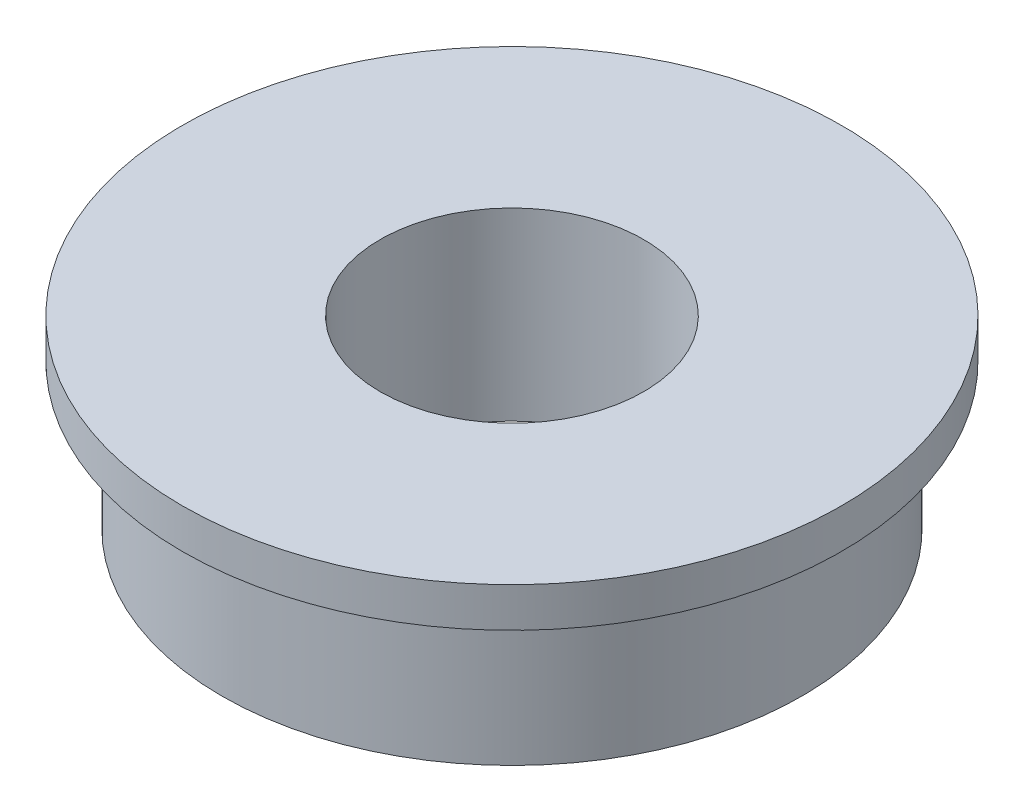
ISO-10303-21;
HEADER;
FILE_DESCRIPTION(('STEP AP214'),'2;1');
FILE_NAME('part.step','',(''),(''),'','','');
FILE_SCHEMA(('AUTOMOTIVE_DESIGN { 1 0 10303 214 1 1 1 1 }'));
ENDSEC;
DATA;
#1=APPLICATION_CONTEXT('core data for automotive mechanical design processes');
#2=APPLICATION_PROTOCOL_DEFINITION('international standard','automotive_design',2000,#1);
#3=PRODUCT_CONTEXT('',#1,'mechanical');
#4=PRODUCT('Part','Part','',(#3));
#5=PRODUCT_RELATED_PRODUCT_CATEGORY('part','',(#4));
#6=PRODUCT_DEFINITION_FORMATION('','',#4);
#7=PRODUCT_DEFINITION_CONTEXT('part definition',#1,'design');
#8=PRODUCT_DEFINITION('design','',#6,#7);
#9=PRODUCT_DEFINITION_SHAPE('','',#8);
#10=(LENGTH_UNIT() NAMED_UNIT(*) SI_UNIT(.MILLI.,.METRE.));
#11=(NAMED_UNIT(*) PLANE_ANGLE_UNIT() SI_UNIT($,.RADIAN.));
#12=(NAMED_UNIT(*) SI_UNIT($,.STERADIAN.) SOLID_ANGLE_UNIT());
#13=UNCERTAINTY_MEASURE_WITH_UNIT(LENGTH_MEASURE(1.E-05),#10,'distance_accuracy_value','');
#14=(GEOMETRIC_REPRESENTATION_CONTEXT(3) GLOBAL_UNCERTAINTY_ASSIGNED_CONTEXT((#13)) GLOBAL_UNIT_ASSIGNED_CONTEXT((#10,
#11,#12)) REPRESENTATION_CONTEXT('',''));
#15=CARTESIAN_POINT('',(0.,0.,0.));
#16=DIRECTION('',(0.,0.,1.));
#17=DIRECTION('',(1.,0.,0.));
#18=AXIS2_PLACEMENT_3D('',#15,#16,#17);
#19=CARTESIAN_POINT('',(0.,3.5,0.));
#20=DIRECTION('',(0.,-1.,0.));
#21=DIRECTION('',(0.,0.,-1.));
#22=AXIS2_PLACEMENT_3D('',#19,#20,#21);
#23=CYLINDRICAL_SURFACE('',#22,11.);
#24=CARTESIAN_POINT('',(0.,-3.5,0.));
#25=DIRECTION('',(0.,1.,0.));
#26=DIRECTION('',(0.,0.,1.));
#27=AXIS2_PLACEMENT_3D('',#24,#25,#26);
#28=CIRCLE('',#27,11.);
#29=CARTESIAN_POINT('',(0.,-3.5,11.));
#30=VERTEX_POINT('',#29);
#31=EDGE_CURVE('E36',#30,#30,#28,.T.);
#32=ORIENTED_EDGE('',*,*,#31,.T.);
#33=EDGE_LOOP('',(#32));
#34=FACE_BOUND('',#33,.T.);
#35=CARTESIAN_POINT('',(0.,2.,0.));
#36=DIRECTION('',(0.,1.,0.));
#37=DIRECTION('',(0.,0.,1.));
#38=AXIS2_PLACEMENT_3D('',#35,#36,#37);
#39=CIRCLE('',#38,11.);
#40=CARTESIAN_POINT('',(0.,2.,11.));
#41=VERTEX_POINT('',#40);
#42=EDGE_CURVE('E10',#41,#41,#39,.T.);
#43=ORIENTED_EDGE('',*,*,#42,.F.);
#44=EDGE_LOOP('',(#43));
#45=FACE_BOUND('',#44,.T.);
#46=ADVANCED_FACE('F30',(#34,#45),#23,.T.);
#47=CARTESIAN_POINT('',(0.,3.5,0.));
#48=DIRECTION('',(0.,1.,0.));
#49=DIRECTION('',(0.,0.,1.));
#50=AXIS2_PLACEMENT_3D('',#47,#48,#49);
#51=PLANE('',#50);
#52=CARTESIAN_POINT('',(0.,3.5,0.));
#53=DIRECTION('',(0.,1.,0.));
#54=DIRECTION('',(0.,0.,1.));
#55=AXIS2_PLACEMENT_3D('',#52,#53,#54);
#56=CIRCLE('',#55,5.);
#57=CARTESIAN_POINT('',(0.,3.5,5.));
#58=VERTEX_POINT('',#57);
#59=EDGE_CURVE('E40',#58,#58,#56,.T.);
#60=ORIENTED_EDGE('',*,*,#59,.F.);
#61=EDGE_LOOP('',(#60));
#62=FACE_BOUND('',#61,.T.);
#63=CARTESIAN_POINT('',(0.,3.5,0.));
#64=DIRECTION('',(0.,1.,0.));
#65=DIRECTION('',(0.,0.,1.));
#66=AXIS2_PLACEMENT_3D('',#63,#64,#65);
#67=CIRCLE('',#66,12.5);
#68=CARTESIAN_POINT('',(0.,3.5,12.5));
#69=VERTEX_POINT('',#68);
#70=EDGE_CURVE('E50',#69,#69,#67,.T.);
#71=ORIENTED_EDGE('',*,*,#70,.T.);
#72=EDGE_LOOP('',(#71));
#73=FACE_BOUND('',#72,.T.);
#74=ADVANCED_FACE('F68',(#62,#73),#51,.T.);
#75=CARTESIAN_POINT('',(0.,-3.5,0.));
#76=DIRECTION('',(0.,1.,0.));
#77=DIRECTION('',(0.,0.,1.));
#78=AXIS2_PLACEMENT_3D('',#75,#76,#77);
#79=PLANE('',#78);
#80=ORIENTED_EDGE('',*,*,#31,.F.);
#81=EDGE_LOOP('',(#80));
#82=FACE_BOUND('',#81,.T.);
#83=CARTESIAN_POINT('',(0.,-3.5,0.));
#84=DIRECTION('',(0.,1.,0.));
#85=DIRECTION('',(0.,0.,1.));
#86=AXIS2_PLACEMENT_3D('',#83,#84,#85);
#87=CIRCLE('',#86,5.);
#88=CARTESIAN_POINT('',(0.,-3.5,5.));
#89=VERTEX_POINT('',#88);
#90=EDGE_CURVE('E44',#89,#89,#87,.T.);
#91=ORIENTED_EDGE('',*,*,#90,.T.);
#92=EDGE_LOOP('',(#91));
#93=FACE_BOUND('',#92,.T.);
#94=ADVANCED_FACE('F72',(#82,#93),#79,.F.);
#95=CARTESIAN_POINT('',(0.,3.5,0.));
#96=DIRECTION('',(0.,-1.,0.));
#97=DIRECTION('',(0.,0.,-1.));
#98=AXIS2_PLACEMENT_3D('',#95,#96,#97);
#99=CYLINDRICAL_SURFACE('',#98,5.);
#100=ORIENTED_EDGE('',*,*,#59,.T.);
#101=EDGE_LOOP('',(#100));
#102=FACE_BOUND('',#101,.T.);
#103=ORIENTED_EDGE('',*,*,#90,.F.);
#104=EDGE_LOOP('',(#103));
#105=FACE_BOUND('',#104,.T.);
#106=ADVANCED_FACE('F65',(#102,#105),#99,.F.);
#107=CARTESIAN_POINT('',(0.,2.,0.));
#108=DIRECTION('',(0.,1.,0.));
#109=DIRECTION('',(0.,0.,1.));
#110=AXIS2_PLACEMENT_3D('',#107,#108,#109);
#111=CYLINDRICAL_SURFACE('',#110,12.5);
#112=CARTESIAN_POINT('',(0.,2.,0.));
#113=DIRECTION('',(0.,1.,0.));
#114=DIRECTION('',(0.,0.,1.));
#115=AXIS2_PLACEMENT_3D('',#112,#113,#114);
#116=CIRCLE('',#115,12.5);
#117=CARTESIAN_POINT('',(0.,2.,12.5));
#118=VERTEX_POINT('',#117);
#119=EDGE_CURVE('E48',#118,#118,#116,.T.);
#120=ORIENTED_EDGE('',*,*,#119,.T.);
#121=EDGE_LOOP('',(#120));
#122=FACE_BOUND('',#121,.T.);
#123=ORIENTED_EDGE('',*,*,#70,.F.);
#124=EDGE_LOOP('',(#123));
#125=FACE_BOUND('',#124,.T.);
#126=ADVANCED_FACE('F56',(#122,#125),#111,.T.);
#127=CARTESIAN_POINT('',(0.,2.,0.));
#128=DIRECTION('',(0.,1.,0.));
#129=DIRECTION('',(0.,0.,1.));
#130=AXIS2_PLACEMENT_3D('',#127,#128,#129);
#131=PLANE('',#130);
#132=ORIENTED_EDGE('',*,*,#42,.T.);
#133=EDGE_LOOP('',(#132));
#134=FACE_BOUND('',#133,.T.);
#135=ORIENTED_EDGE('',*,*,#119,.F.);
#136=EDGE_LOOP('',(#135));
#137=FACE_BOUND('',#136,.T.);
#138=ADVANCED_FACE('F59',(#134,#137),#131,.F.);
#139=CLOSED_SHELL('',(#46,#74,#94,#106,#126,#138));
#140=MANIFOLD_SOLID_BREP('B2',#139);
#141=ADVANCED_BREP_SHAPE_REPRESENTATION('',(#18,#140),#14);
#142=SHAPE_DEFINITION_REPRESENTATION(#9,#141);
ENDSEC;
END-ISO-10303-21;
